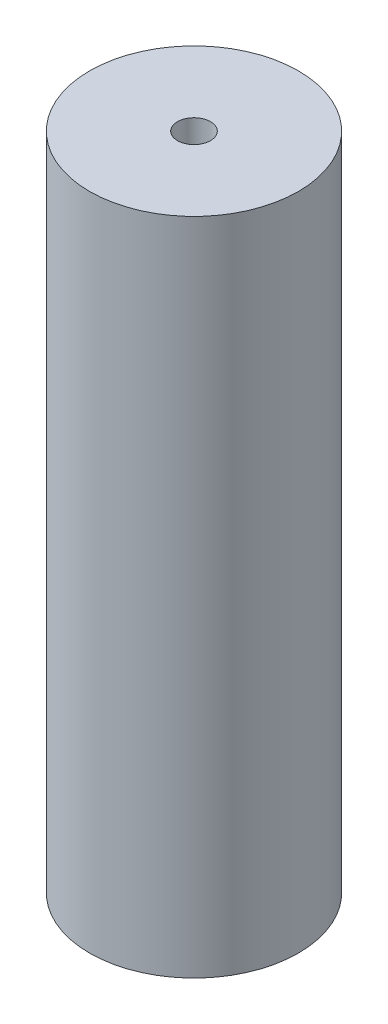
ISO-10303-21;
HEADER;
FILE_DESCRIPTION(('STEP AP214'),'2;1');
FILE_NAME('part.step','',(''),(''),'','','');
FILE_SCHEMA(('AUTOMOTIVE_DESIGN { 1 0 10303 214 1 1 1 1 }'));
ENDSEC;
DATA;
#1=APPLICATION_CONTEXT('core data for automotive mechanical design processes');
#2=APPLICATION_PROTOCOL_DEFINITION('international standard','automotive_design',2000,#1);
#3=PRODUCT_CONTEXT('',#1,'mechanical');
#4=PRODUCT('Part','Part','',(#3));
#5=PRODUCT_RELATED_PRODUCT_CATEGORY('part','',(#4));
#6=PRODUCT_DEFINITION_FORMATION('','',#4);
#7=PRODUCT_DEFINITION_CONTEXT('part definition',#1,'design');
#8=PRODUCT_DEFINITION('design','',#6,#7);
#9=PRODUCT_DEFINITION_SHAPE('','',#8);
#10=(LENGTH_UNIT() NAMED_UNIT(*) SI_UNIT(.MILLI.,.METRE.));
#11=(NAMED_UNIT(*) PLANE_ANGLE_UNIT() SI_UNIT($,.RADIAN.));
#12=(NAMED_UNIT(*) SI_UNIT($,.STERADIAN.) SOLID_ANGLE_UNIT());
#13=UNCERTAINTY_MEASURE_WITH_UNIT(LENGTH_MEASURE(1.E-05),#10,'distance_accuracy_value','');
#14=(GEOMETRIC_REPRESENTATION_CONTEXT(3) GLOBAL_UNCERTAINTY_ASSIGNED_CONTEXT((#13)) GLOBAL_UNIT_ASSIGNED_CONTEXT((#10,
#11,#12)) REPRESENTATION_CONTEXT('',''));
#15=CARTESIAN_POINT('',(0.,0.,0.));
#16=DIRECTION('',(0.,0.,1.));
#17=DIRECTION('',(1.,0.,0.));
#18=AXIS2_PLACEMENT_3D('',#15,#16,#17);
#19=CARTESIAN_POINT('',(0.,30.,0.));
#20=DIRECTION('',(0.,-1.,0.));
#21=DIRECTION('',(0.,0.,-1.));
#22=AXIS2_PLACEMENT_3D('',#19,#20,#21);
#23=CYLINDRICAL_SURFACE('',#22,9.5);
#24=CARTESIAN_POINT('',(0.,30.,0.));
#25=DIRECTION('',(0.,1.,0.));
#26=DIRECTION('',(0.,0.,1.));
#27=AXIS2_PLACEMENT_3D('',#24,#25,#26);
#28=CIRCLE('',#27,9.5);
#29=CARTESIAN_POINT('',(0.,30.,9.5));
#30=VERTEX_POINT('',#29);
#31=EDGE_CURVE('E10',#30,#30,#28,.T.);
#32=ORIENTED_EDGE('',*,*,#31,.F.);
#33=EDGE_LOOP('',(#32));
#34=FACE_BOUND('',#33,.T.);
#35=CARTESIAN_POINT('',(0.,-30.,0.));
#36=DIRECTION('',(0.,1.,0.));
#37=DIRECTION('',(0.,0.,1.));
#38=AXIS2_PLACEMENT_3D('',#35,#36,#37);
#39=CIRCLE('',#38,9.5);
#40=CARTESIAN_POINT('',(0.,-30.,9.5));
#41=VERTEX_POINT('',#40);
#42=EDGE_CURVE('E34',#41,#41,#39,.T.);
#43=ORIENTED_EDGE('',*,*,#42,.T.);
#44=EDGE_LOOP('',(#43));
#45=FACE_BOUND('',#44,.T.);
#46=ADVANCED_FACE('F31',(#34,#45),#23,.T.);
#47=CARTESIAN_POINT('',(0.,30.,0.));
#48=DIRECTION('',(0.,1.,0.));
#49=DIRECTION('',(0.,0.,1.));
#50=AXIS2_PLACEMENT_3D('',#47,#48,#49);
#51=PLANE('',#50);
#52=CARTESIAN_POINT('',(0.,30.,0.));
#53=DIRECTION('',(0.,1.,0.));
#54=DIRECTION('',(0.,0.,1.));
#55=AXIS2_PLACEMENT_3D('',#52,#53,#54);
#56=CIRCLE('',#55,1.5);
#57=CARTESIAN_POINT('',(0.,30.,1.5));
#58=VERTEX_POINT('',#57);
#59=EDGE_CURVE('E43',#58,#58,#56,.T.);
#60=ORIENTED_EDGE('',*,*,#59,.F.);
#61=EDGE_LOOP('',(#60));
#62=FACE_BOUND('',#61,.T.);
#63=ORIENTED_EDGE('',*,*,#31,.T.);
#64=EDGE_LOOP('',(#63));
#65=FACE_BOUND('',#64,.T.);
#66=ADVANCED_FACE('F58',(#62,#65),#51,.T.);
#67=CARTESIAN_POINT('',(0.,-30.,0.));
#68=DIRECTION('',(0.,1.,0.));
#69=DIRECTION('',(0.,0.,1.));
#70=AXIS2_PLACEMENT_3D('',#67,#68,#69);
#71=PLANE('',#70);
#72=CARTESIAN_POINT('',(0.,-30.,0.));
#73=DIRECTION('',(0.,1.,0.));
#74=DIRECTION('',(0.,0.,1.));
#75=AXIS2_PLACEMENT_3D('',#72,#73,#74);
#76=CIRCLE('',#75,1.5);
#77=CARTESIAN_POINT('',(0.,-30.,1.5));
#78=VERTEX_POINT('',#77);
#79=EDGE_CURVE('E41',#78,#78,#76,.T.);
#80=ORIENTED_EDGE('',*,*,#79,.T.);
#81=EDGE_LOOP('',(#80));
#82=FACE_BOUND('',#81,.T.);
#83=ORIENTED_EDGE('',*,*,#42,.F.);
#84=EDGE_LOOP('',(#83));
#85=FACE_BOUND('',#84,.T.);
#86=ADVANCED_FACE('F49',(#82,#85),#71,.F.);
#87=CARTESIAN_POINT('',(0.,-30.,0.));
#88=DIRECTION('',(0.,1.,0.));
#89=DIRECTION('',(0.,0.,1.));
#90=AXIS2_PLACEMENT_3D('',#87,#88,#89);
#91=CYLINDRICAL_SURFACE('',#90,1.5);
#92=ORIENTED_EDGE('',*,*,#79,.F.);
#93=EDGE_LOOP('',(#92));
#94=FACE_BOUND('',#93,.T.);
#95=ORIENTED_EDGE('',*,*,#59,.T.);
#96=EDGE_LOOP('',(#95));
#97=FACE_BOUND('',#96,.T.);
#98=ADVANCED_FACE('F52',(#94,#97),#91,.F.);
#99=CLOSED_SHELL('',(#46,#66,#86,#98));
#100=MANIFOLD_SOLID_BREP('B2',#99);
#101=ADVANCED_BREP_SHAPE_REPRESENTATION('',(#18,#100),#14);
#102=SHAPE_DEFINITION_REPRESENTATION(#9,#101);
ENDSEC;
END-ISO-10303-21;
